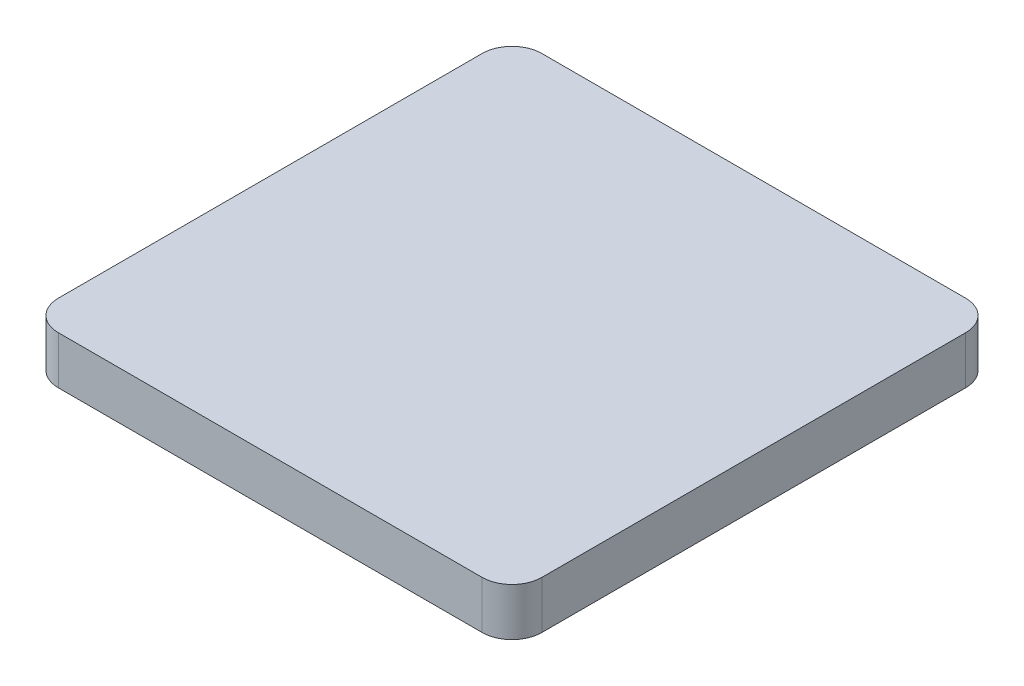
ISO-10303-21;
HEADER;
FILE_DESCRIPTION(('STEP AP214'),'2;1');
FILE_NAME('part.step','',(''),(''),'','','');
FILE_SCHEMA(('AUTOMOTIVE_DESIGN { 1 0 10303 214 1 1 1 1 }'));
ENDSEC;
DATA;
#1=APPLICATION_CONTEXT('core data for automotive mechanical design processes');
#2=APPLICATION_PROTOCOL_DEFINITION('international standard','automotive_design',2000,#1);
#3=PRODUCT_CONTEXT('',#1,'mechanical');
#4=PRODUCT('Part','Part','',(#3));
#5=PRODUCT_RELATED_PRODUCT_CATEGORY('part','',(#4));
#6=PRODUCT_DEFINITION_FORMATION('','',#4);
#7=PRODUCT_DEFINITION_CONTEXT('part definition',#1,'design');
#8=PRODUCT_DEFINITION('design','',#6,#7);
#9=PRODUCT_DEFINITION_SHAPE('','',#8);
#10=(LENGTH_UNIT() NAMED_UNIT(*) SI_UNIT(.MILLI.,.METRE.));
#11=(NAMED_UNIT(*) PLANE_ANGLE_UNIT() SI_UNIT($,.RADIAN.));
#12=(NAMED_UNIT(*) SI_UNIT($,.STERADIAN.) SOLID_ANGLE_UNIT());
#13=UNCERTAINTY_MEASURE_WITH_UNIT(LENGTH_MEASURE(1.E-05),#10,'distance_accuracy_value','');
#14=(GEOMETRIC_REPRESENTATION_CONTEXT(3) GLOBAL_UNCERTAINTY_ASSIGNED_CONTEXT((#13)) GLOBAL_UNIT_ASSIGNED_CONTEXT((#10,
#11,#12)) REPRESENTATION_CONTEXT('',''));
#15=CARTESIAN_POINT('',(0.,0.,0.));
#16=DIRECTION('',(0.,0.,1.));
#17=DIRECTION('',(1.,0.,0.));
#18=AXIS2_PLACEMENT_3D('',#15,#16,#17);
#19=CARTESIAN_POINT('',(0.,4.,40.5));
#20=DIRECTION('',(0.,0.,-1.));
#21=DIRECTION('',(-1.,0.,0.));
#22=AXIS2_PLACEMENT_3D('',#19,#20,#21);
#23=PLANE('',#22);
#24=DIRECTION('',(1.,0.,0.));
#25=VECTOR('',#24,1.);
#26=CARTESIAN_POINT('',(0.,-4.,40.5));
#27=LINE('',#26,#25);
#28=CARTESIAN_POINT('',(-35.5,-4.,40.5));
#29=VERTEX_POINT('',#28);
#30=CARTESIAN_POINT('',(35.5,-4.,40.5));
#31=VERTEX_POINT('',#30);
#32=EDGE_CURVE('E229',#29,#31,#27,.T.);
#33=ORIENTED_EDGE('',*,*,#32,.T.);
#34=DIRECTION('',(0.,-1.,0.));
#35=VECTOR('',#34,1.);
#36=CARTESIAN_POINT('',(35.5,4.,40.5));
#37=LINE('',#36,#35);
#38=CARTESIAN_POINT('',(35.5,4.,40.5));
#39=VERTEX_POINT('',#38);
#40=EDGE_CURVE('E281',#31,#39,#37,.F.);
#41=ORIENTED_EDGE('',*,*,#40,.T.);
#42=DIRECTION('',(1.,0.,0.));
#43=VECTOR('',#42,1.);
#44=CARTESIAN_POINT('',(0.,4.,40.5));
#45=LINE('',#44,#43);
#46=CARTESIAN_POINT('',(-35.5,4.,40.5));
#47=VERTEX_POINT('',#46);
#48=EDGE_CURVE('E243',#47,#39,#45,.T.);
#49=ORIENTED_EDGE('',*,*,#48,.F.);
#50=DIRECTION('',(0.,-1.,0.));
#51=VECTOR('',#50,1.);
#52=CARTESIAN_POINT('',(-35.5,-4.,40.5));
#53=LINE('',#52,#51);
#54=EDGE_CURVE('E278',#47,#29,#53,.T.);
#55=ORIENTED_EDGE('',*,*,#54,.T.);
#56=EDGE_LOOP('',(#33,#41,#49,#55));
#57=FACE_BOUND('',#56,.T.);
#58=ADVANCED_FACE('F39',(#57),#23,.F.);
#59=CARTESIAN_POINT('',(40.5,4.,0.));
#60=DIRECTION('',(-1.,0.,0.));
#61=DIRECTION('',(0.,0.,1.));
#62=AXIS2_PLACEMENT_3D('',#59,#60,#61);
#63=PLANE('',#62);
#64=DIRECTION('',(0.,0.,-1.));
#65=VECTOR('',#64,1.);
#66=CARTESIAN_POINT('',(40.5,4.,0.));
#67=LINE('',#66,#65);
#68=CARTESIAN_POINT('',(40.5,4.,35.5));
#69=VERTEX_POINT('',#68);
#70=CARTESIAN_POINT('',(40.5,4.,-35.5));
#71=VERTEX_POINT('',#70);
#72=EDGE_CURVE('E246',#69,#71,#67,.T.);
#73=ORIENTED_EDGE('',*,*,#72,.F.);
#74=DIRECTION('',(0.,-1.,0.));
#75=VECTOR('',#74,1.);
#76=CARTESIAN_POINT('',(40.5,4.,35.5));
#77=LINE('',#76,#75);
#78=CARTESIAN_POINT('',(40.5,-4.,35.5));
#79=VERTEX_POINT('',#78);
#80=EDGE_CURVE('E267',#69,#79,#77,.T.);
#81=ORIENTED_EDGE('',*,*,#80,.T.);
#82=DIRECTION('',(0.,0.,-1.));
#83=VECTOR('',#82,1.);
#84=CARTESIAN_POINT('',(40.5,-4.,0.));
#85=LINE('',#84,#83);
#86=CARTESIAN_POINT('',(40.5,-4.,-35.5));
#87=VERTEX_POINT('',#86);
#88=EDGE_CURVE('E258',#79,#87,#85,.T.);
#89=ORIENTED_EDGE('',*,*,#88,.T.);
#90=DIRECTION('',(0.,-1.,0.));
#91=VECTOR('',#90,1.);
#92=CARTESIAN_POINT('',(40.5,4.,-35.5));
#93=LINE('',#92,#91);
#94=EDGE_CURVE('E255',#87,#71,#93,.F.);
#95=ORIENTED_EDGE('',*,*,#94,.T.);
#96=EDGE_LOOP('',(#73,#81,#89,#95));
#97=FACE_BOUND('',#96,.T.);
#98=ADVANCED_FACE('F320',(#97),#63,.F.);
#99=CARTESIAN_POINT('',(0.,4.,-40.5));
#100=DIRECTION('',(0.,0.,-1.));
#101=DIRECTION('',(-1.,0.,0.));
#102=AXIS2_PLACEMENT_3D('',#99,#100,#101);
#103=PLANE('',#102);
#104=DIRECTION('',(1.,0.,0.));
#105=VECTOR('',#104,1.);
#106=CARTESIAN_POINT('',(0.,4.,-40.5));
#107=LINE('',#106,#105);
#108=CARTESIAN_POINT('',(-35.5,4.,-40.5));
#109=VERTEX_POINT('',#108);
#110=CARTESIAN_POINT('',(35.5,4.,-40.5));
#111=VERTEX_POINT('',#110);
#112=EDGE_CURVE('E250',#109,#111,#107,.T.);
#113=ORIENTED_EDGE('',*,*,#112,.T.);
#114=DIRECTION('',(0.,-1.,0.));
#115=VECTOR('',#114,1.);
#116=CARTESIAN_POINT('',(35.5,-4.,-40.5));
#117=LINE('',#116,#115);
#118=CARTESIAN_POINT('',(35.5,-4.,-40.5));
#119=VERTEX_POINT('',#118);
#120=EDGE_CURVE('E292',#111,#119,#117,.T.);
#121=ORIENTED_EDGE('',*,*,#120,.T.);
#122=DIRECTION('',(1.,0.,0.));
#123=VECTOR('',#122,1.);
#124=CARTESIAN_POINT('',(0.,-4.,-40.5));
#125=LINE('',#124,#123);
#126=CARTESIAN_POINT('',(-35.5,-4.,-40.5));
#127=VERTEX_POINT('',#126);
#128=EDGE_CURVE('E261',#127,#119,#125,.T.);
#129=ORIENTED_EDGE('',*,*,#128,.F.);
#130=DIRECTION('',(0.,-1.,0.));
#131=VECTOR('',#130,1.);
#132=CARTESIAN_POINT('',(-35.5,4.,-40.5));
#133=LINE('',#132,#131);
#134=EDGE_CURVE('E290',#127,#109,#133,.F.);
#135=ORIENTED_EDGE('',*,*,#134,.T.);
#136=EDGE_LOOP('',(#113,#121,#129,#135));
#137=FACE_BOUND('',#136,.T.);
#138=ADVANCED_FACE('F297',(#137),#103,.T.);
#139=CARTESIAN_POINT('',(-40.5,4.,0.));
#140=DIRECTION('',(-1.,0.,0.));
#141=DIRECTION('',(0.,0.,1.));
#142=AXIS2_PLACEMENT_3D('',#139,#140,#141);
#143=PLANE('',#142);
#144=DIRECTION('',(0.,0.,-1.));
#145=VECTOR('',#144,1.);
#146=CARTESIAN_POINT('',(-40.5,4.,0.));
#147=LINE('',#146,#145);
#148=CARTESIAN_POINT('',(-40.5,4.,35.5));
#149=VERTEX_POINT('',#148);
#150=CARTESIAN_POINT('',(-40.5,4.,-35.5));
#151=VERTEX_POINT('',#150);
#152=EDGE_CURVE('E253',#149,#151,#147,.T.);
#153=ORIENTED_EDGE('',*,*,#152,.T.);
#154=DIRECTION('',(0.,-1.,0.));
#155=VECTOR('',#154,1.);
#156=CARTESIAN_POINT('',(-40.5,4.,-35.5));
#157=LINE('',#156,#155);
#158=CARTESIAN_POINT('',(-40.5,-4.,-35.5));
#159=VERTEX_POINT('',#158);
#160=EDGE_CURVE('E11',#151,#159,#157,.T.);
#161=ORIENTED_EDGE('',*,*,#160,.T.);
#162=DIRECTION('',(0.,0.,-1.));
#163=VECTOR('',#162,1.);
#164=CARTESIAN_POINT('',(-40.5,-4.,0.));
#165=LINE('',#164,#163);
#166=CARTESIAN_POINT('',(-40.5,-4.,35.5));
#167=VERTEX_POINT('',#166);
#168=EDGE_CURVE('E247',#167,#159,#165,.T.);
#169=ORIENTED_EDGE('',*,*,#168,.F.);
#170=DIRECTION('',(0.,-1.,0.));
#171=VECTOR('',#170,1.);
#172=CARTESIAN_POINT('',(-40.5,4.,35.5));
#173=LINE('',#172,#171);
#174=EDGE_CURVE('E47',#167,#149,#173,.F.);
#175=ORIENTED_EDGE('',*,*,#174,.T.);
#176=EDGE_LOOP('',(#153,#161,#169,#175));
#177=FACE_BOUND('',#176,.T.);
#178=ADVANCED_FACE('F305',(#177),#143,.T.);
#179=CARTESIAN_POINT('',(0.,4.,0.));
#180=DIRECTION('',(0.,1.,0.));
#181=DIRECTION('',(0.,0.,1.));
#182=AXIS2_PLACEMENT_3D('',#179,#180,#181);
#183=PLANE('',#182);
#184=ORIENTED_EDGE('',*,*,#48,.T.);
#185=CARTESIAN_POINT('',(35.5,4.,35.5));
#186=DIRECTION('',(0.,1.,0.));
#187=DIRECTION('',(0.,0.,1.));
#188=AXIS2_PLACEMENT_3D('',#185,#186,#187);
#189=CIRCLE('',#188,5.);
#190=EDGE_CURVE('E288',#39,#69,#189,.T.);
#191=ORIENTED_EDGE('',*,*,#190,.T.);
#192=ORIENTED_EDGE('',*,*,#72,.T.);
#193=CARTESIAN_POINT('',(35.5,4.,-35.5));
#194=DIRECTION('',(0.,1.,0.));
#195=DIRECTION('',(0.,0.,1.));
#196=AXIS2_PLACEMENT_3D('',#193,#194,#195);
#197=CIRCLE('',#196,5.);
#198=EDGE_CURVE('E286',#71,#111,#197,.T.);
#199=ORIENTED_EDGE('',*,*,#198,.T.);
#200=ORIENTED_EDGE('',*,*,#112,.F.);
#201=CARTESIAN_POINT('',(-35.5,4.,-35.5));
#202=DIRECTION('',(0.,1.,0.));
#203=DIRECTION('',(0.,0.,1.));
#204=AXIS2_PLACEMENT_3D('',#201,#202,#203);
#205=CIRCLE('',#204,5.);
#206=EDGE_CURVE('E54',#109,#151,#205,.T.);
#207=ORIENTED_EDGE('',*,*,#206,.T.);
#208=ORIENTED_EDGE('',*,*,#152,.F.);
#209=CARTESIAN_POINT('',(-35.5,4.,35.5));
#210=DIRECTION('',(0.,1.,0.));
#211=DIRECTION('',(0.,0.,1.));
#212=AXIS2_PLACEMENT_3D('',#209,#210,#211);
#213=CIRCLE('',#212,5.);
#214=EDGE_CURVE('E283',#149,#47,#213,.T.);
#215=ORIENTED_EDGE('',*,*,#214,.T.);
#216=EDGE_LOOP('',(#184,#191,#192,#199,#200,#207,#208,#215));
#217=FACE_BOUND('',#216,.T.);
#218=ADVANCED_FACE('F307',(#217),#183,.T.);
#219=CARTESIAN_POINT('',(0.,-4.,0.));
#220=DIRECTION('',(0.,1.,0.));
#221=DIRECTION('',(0.,0.,1.));
#222=AXIS2_PLACEMENT_3D('',#219,#220,#221);
#223=PLANE('',#222);
#224=CARTESIAN_POINT('',(32.5,-4.,-32.5));
#225=DIRECTION('',(0.,1.,0.));
#226=DIRECTION('',(0.,0.,1.));
#227=AXIS2_PLACEMENT_3D('',#224,#225,#226);
#228=CIRCLE('',#227,4.);
#229=CARTESIAN_POINT('',(36.5,-4.,-32.5));
#230=VERTEX_POINT('',#229);
#231=CARTESIAN_POINT('',(32.5,-4.,-36.5));
#232=VERTEX_POINT('',#231);
#233=EDGE_CURVE('E171',#230,#232,#228,.T.);
#234=ORIENTED_EDGE('',*,*,#233,.T.);
#235=CARTESIAN_POINT('',(27.5,-4.,-36.5));
#236=DIRECTION('',(0.,-1.,0.));
#237=DIRECTION('',(0.,0.,1.));
#238=AXIS2_PLACEMENT_3D('',#235,#236,#237);
#239=CIRCLE('',#238,5.);
#240=CARTESIAN_POINT('',(22.5,-4.,-36.5));
#241=VERTEX_POINT('',#240);
#242=EDGE_CURVE('E163',#232,#241,#239,.T.);
#243=ORIENTED_EDGE('',*,*,#242,.T.);
#244=DIRECTION('',(-1.,0.,0.));
#245=VECTOR('',#244,1.);
#246=CARTESIAN_POINT('',(22.5,-4.,-36.5));
#247=LINE('',#246,#245);
#248=CARTESIAN_POINT('',(-32.5,-4.,-36.5));
#249=VERTEX_POINT('',#248);
#250=EDGE_CURVE('E175',#241,#249,#247,.T.);
#251=ORIENTED_EDGE('',*,*,#250,.T.);
#252=CARTESIAN_POINT('',(-32.5,-4.,-32.5));
#253=DIRECTION('',(0.,1.,0.));
#254=DIRECTION('',(0.,0.,1.));
#255=AXIS2_PLACEMENT_3D('',#252,#253,#254);
#256=CIRCLE('',#255,4.);
#257=CARTESIAN_POINT('',(-36.5,-4.,-32.5));
#258=VERTEX_POINT('',#257);
#259=EDGE_CURVE('E179',#249,#258,#256,.T.);
#260=ORIENTED_EDGE('',*,*,#259,.T.);
#261=DIRECTION('',(0.,0.,1.));
#262=VECTOR('',#261,1.);
#263=CARTESIAN_POINT('',(-36.5,-4.,-32.5));
#264=LINE('',#263,#262);
#265=CARTESIAN_POINT('',(-36.5,-4.,32.5));
#266=VERTEX_POINT('',#265);
#267=EDGE_CURVE('E192',#258,#266,#264,.T.);
#268=ORIENTED_EDGE('',*,*,#267,.T.);
#269=CARTESIAN_POINT('',(-32.5,-4.,32.5));
#270=DIRECTION('',(0.,1.,0.));
#271=DIRECTION('',(0.,0.,1.));
#272=AXIS2_PLACEMENT_3D('',#269,#270,#271);
#273=CIRCLE('',#272,4.);
#274=CARTESIAN_POINT('',(-32.5,-4.,36.5));
#275=VERTEX_POINT('',#274);
#276=EDGE_CURVE('E195',#266,#275,#273,.T.);
#277=ORIENTED_EDGE('',*,*,#276,.T.);
#278=DIRECTION('',(1.,0.,0.));
#279=VECTOR('',#278,1.);
#280=CARTESIAN_POINT('',(-32.5,-4.,36.5));
#281=LINE('',#280,#279);
#282=CARTESIAN_POINT('',(32.5,-4.,36.5));
#283=VERTEX_POINT('',#282);
#284=EDGE_CURVE('E198',#275,#283,#281,.T.);
#285=ORIENTED_EDGE('',*,*,#284,.T.);
#286=CARTESIAN_POINT('',(32.5,-4.,32.5));
#287=DIRECTION('',(0.,1.,0.));
#288=DIRECTION('',(0.,0.,1.));
#289=AXIS2_PLACEMENT_3D('',#286,#287,#288);
#290=CIRCLE('',#289,4.);
#291=CARTESIAN_POINT('',(36.5,-4.,32.5));
#292=VERTEX_POINT('',#291);
#293=EDGE_CURVE('E201',#283,#292,#290,.T.);
#294=ORIENTED_EDGE('',*,*,#293,.T.);
#295=DIRECTION('',(0.,0.,-1.));
#296=VECTOR('',#295,1.);
#297=CARTESIAN_POINT('',(36.5,-4.,32.5));
#298=LINE('',#297,#296);
#299=EDGE_CURVE('E204',#292,#230,#298,.T.);
#300=ORIENTED_EDGE('',*,*,#299,.T.);
#301=EDGE_LOOP('',(#234,#243,#251,#260,#268,#277,#285,#294,#300));
#302=FACE_BOUND('',#301,.T.);
#303=ORIENTED_EDGE('',*,*,#88,.F.);
#304=CARTESIAN_POINT('',(35.5,-4.,35.5));
#305=DIRECTION('',(0.,1.,0.));
#306=DIRECTION('',(0.,0.,1.));
#307=AXIS2_PLACEMENT_3D('',#304,#305,#306);
#308=CIRCLE('',#307,5.);
#309=EDGE_CURVE('E276',#79,#31,#308,.F.);
#310=ORIENTED_EDGE('',*,*,#309,.T.);
#311=ORIENTED_EDGE('',*,*,#32,.F.);
#312=CARTESIAN_POINT('',(-35.5,-4.,35.5));
#313=DIRECTION('',(0.,1.,0.));
#314=DIRECTION('',(0.,0.,1.));
#315=AXIS2_PLACEMENT_3D('',#312,#313,#314);
#316=CIRCLE('',#315,5.);
#317=EDGE_CURVE('E270',#29,#167,#316,.F.);
#318=ORIENTED_EDGE('',*,*,#317,.T.);
#319=ORIENTED_EDGE('',*,*,#168,.T.);
#320=CARTESIAN_POINT('',(-35.5,-4.,-35.5));
#321=DIRECTION('',(0.,1.,0.));
#322=DIRECTION('',(0.,0.,1.));
#323=AXIS2_PLACEMENT_3D('',#320,#321,#322);
#324=CIRCLE('',#323,5.);
#325=EDGE_CURVE('E272',#159,#127,#324,.F.);
#326=ORIENTED_EDGE('',*,*,#325,.T.);
#327=ORIENTED_EDGE('',*,*,#128,.T.);
#328=CARTESIAN_POINT('',(35.5,-4.,-35.5));
#329=DIRECTION('',(0.,1.,0.));
#330=DIRECTION('',(0.,0.,1.));
#331=AXIS2_PLACEMENT_3D('',#328,#329,#330);
#332=CIRCLE('',#331,5.);
#333=EDGE_CURVE('E274',#119,#87,#332,.F.);
#334=ORIENTED_EDGE('',*,*,#333,.T.);
#335=EDGE_LOOP('',(#303,#310,#311,#318,#319,#326,#327,#334));
#336=FACE_BOUND('',#335,.T.);
#337=ADVANCED_FACE('F181',(#302,#336),#223,.F.);
#338=CARTESIAN_POINT('',(27.5,-4.,-36.5));
#339=DIRECTION('',(0.,1.,0.));
#340=DIRECTION('',(0.,0.,1.));
#341=AXIS2_PLACEMENT_3D('',#338,#339,#340);
#342=CYLINDRICAL_SURFACE('',#341,5.);
#343=CARTESIAN_POINT('',(27.5,0.,-36.5));
#344=DIRECTION('',(0.,-1.,0.));
#345=DIRECTION('',(0.,0.,1.));
#346=AXIS2_PLACEMENT_3D('',#343,#344,#345);
#347=CIRCLE('',#346,5.);
#348=CARTESIAN_POINT('',(32.5,0.,-36.5));
#349=VERTEX_POINT('',#348);
#350=CARTESIAN_POINT('',(22.5,0.,-36.5));
#351=VERTEX_POINT('',#350);
#352=EDGE_CURVE('E166',#349,#351,#347,.T.);
#353=ORIENTED_EDGE('',*,*,#352,.T.);
#354=DIRECTION('',(0.,1.,0.));
#355=VECTOR('',#354,1.);
#356=CARTESIAN_POINT('',(22.5,-4.,-36.5));
#357=LINE('',#356,#355);
#358=EDGE_CURVE('E159',#241,#351,#357,.T.);
#359=ORIENTED_EDGE('',*,*,#358,.F.);
#360=ORIENTED_EDGE('',*,*,#242,.F.);
#361=DIRECTION('',(0.,1.,0.));
#362=VECTOR('',#361,1.);
#363=CARTESIAN_POINT('',(32.5,-4.,-36.5));
#364=LINE('',#363,#362);
#365=EDGE_CURVE('E227',#232,#349,#364,.T.);
#366=ORIENTED_EDGE('',*,*,#365,.T.);
#367=EDGE_LOOP('',(#353,#359,#360,#366));
#368=FACE_BOUND('',#367,.T.);
#369=ADVANCED_FACE('F161',(#368),#342,.T.);
#370=CARTESIAN_POINT('',(32.5,-4.,-32.5));
#371=DIRECTION('',(0.,1.,0.));
#372=DIRECTION('',(0.,0.,1.));
#373=AXIS2_PLACEMENT_3D('',#370,#371,#372);
#374=CYLINDRICAL_SURFACE('',#373,4.);
#375=CARTESIAN_POINT('',(32.5,0.,-32.5));
#376=DIRECTION('',(0.,1.,0.));
#377=DIRECTION('',(0.,0.,1.));
#378=AXIS2_PLACEMENT_3D('',#375,#376,#377);
#379=CIRCLE('',#378,4.);
#380=CARTESIAN_POINT('',(36.5,0.,-32.5));
#381=VERTEX_POINT('',#380);
#382=EDGE_CURVE('E185',#381,#349,#379,.T.);
#383=ORIENTED_EDGE('',*,*,#382,.T.);
#384=ORIENTED_EDGE('',*,*,#365,.F.);
#385=ORIENTED_EDGE('',*,*,#233,.F.);
#386=DIRECTION('',(0.,1.,0.));
#387=VECTOR('',#386,1.);
#388=CARTESIAN_POINT('',(36.5,-4.,-32.5));
#389=LINE('',#388,#387);
#390=EDGE_CURVE('E230',#230,#381,#389,.T.);
#391=ORIENTED_EDGE('',*,*,#390,.T.);
#392=EDGE_LOOP('',(#383,#384,#385,#391));
#393=FACE_BOUND('',#392,.T.);
#394=ADVANCED_FACE('F349',(#393),#374,.F.);
#395=CARTESIAN_POINT('',(36.5,-4.,32.5));
#396=DIRECTION('',(1.,0.,0.));
#397=DIRECTION('',(0.,0.,-1.));
#398=AXIS2_PLACEMENT_3D('',#395,#396,#397);
#399=PLANE('',#398);
#400=DIRECTION('',(0.,0.,-1.));
#401=VECTOR('',#400,1.);
#402=CARTESIAN_POINT('',(36.5,0.,32.5));
#403=LINE('',#402,#401);
#404=CARTESIAN_POINT('',(36.5,0.,32.5));
#405=VERTEX_POINT('',#404);
#406=EDGE_CURVE('E188',#405,#381,#403,.T.);
#407=ORIENTED_EDGE('',*,*,#406,.T.);
#408=ORIENTED_EDGE('',*,*,#390,.F.);
#409=ORIENTED_EDGE('',*,*,#299,.F.);
#410=DIRECTION('',(0.,1.,0.));
#411=VECTOR('',#410,1.);
#412=CARTESIAN_POINT('',(36.5,-4.,32.5));
#413=LINE('',#412,#411);
#414=EDGE_CURVE('E232',#292,#405,#413,.T.);
#415=ORIENTED_EDGE('',*,*,#414,.T.);
#416=EDGE_LOOP('',(#407,#408,#409,#415));
#417=FACE_BOUND('',#416,.T.);
#418=ADVANCED_FACE('F371',(#417),#399,.F.);
#419=CARTESIAN_POINT('',(32.5,-4.,32.5));
#420=DIRECTION('',(0.,1.,0.));
#421=DIRECTION('',(0.,0.,1.));
#422=AXIS2_PLACEMENT_3D('',#419,#420,#421);
#423=CYLINDRICAL_SURFACE('',#422,4.);
#424=CARTESIAN_POINT('',(32.5,0.,32.5));
#425=DIRECTION('',(0.,1.,0.));
#426=DIRECTION('',(0.,0.,1.));
#427=AXIS2_PLACEMENT_3D('',#424,#425,#426);
#428=CIRCLE('',#427,4.);
#429=CARTESIAN_POINT('',(32.5,0.,36.5));
#430=VERTEX_POINT('',#429);
#431=EDGE_CURVE('E222',#430,#405,#428,.T.);
#432=ORIENTED_EDGE('',*,*,#431,.T.);
#433=ORIENTED_EDGE('',*,*,#414,.F.);
#434=ORIENTED_EDGE('',*,*,#293,.F.);
#435=DIRECTION('',(0.,1.,0.));
#436=VECTOR('',#435,1.);
#437=CARTESIAN_POINT('',(32.5,-4.,36.5));
#438=LINE('',#437,#436);
#439=EDGE_CURVE('E234',#283,#430,#438,.T.);
#440=ORIENTED_EDGE('',*,*,#439,.T.);
#441=EDGE_LOOP('',(#432,#433,#434,#440));
#442=FACE_BOUND('',#441,.T.);
#443=ADVANCED_FACE('F367',(#442),#423,.F.);
#444=CARTESIAN_POINT('',(-32.5,-4.,36.5));
#445=DIRECTION('',(0.,0.,1.));
#446=DIRECTION('',(1.,0.,0.));
#447=AXIS2_PLACEMENT_3D('',#444,#445,#446);
#448=PLANE('',#447);
#449=DIRECTION('',(1.,0.,0.));
#450=VECTOR('',#449,1.);
#451=CARTESIAN_POINT('',(-32.5,0.,36.5));
#452=LINE('',#451,#450);
#453=CARTESIAN_POINT('',(-32.5,0.,36.5));
#454=VERTEX_POINT('',#453);
#455=EDGE_CURVE('E219',#454,#430,#452,.T.);
#456=ORIENTED_EDGE('',*,*,#455,.T.);
#457=ORIENTED_EDGE('',*,*,#439,.F.);
#458=ORIENTED_EDGE('',*,*,#284,.F.);
#459=DIRECTION('',(0.,1.,0.));
#460=VECTOR('',#459,1.);
#461=CARTESIAN_POINT('',(-32.5,-4.,36.5));
#462=LINE('',#461,#460);
#463=EDGE_CURVE('E236',#275,#454,#462,.T.);
#464=ORIENTED_EDGE('',*,*,#463,.T.);
#465=EDGE_LOOP('',(#456,#457,#458,#464));
#466=FACE_BOUND('',#465,.T.);
#467=ADVANCED_FACE('F363',(#466),#448,.F.);
#468=CARTESIAN_POINT('',(-32.5,-4.,32.5));
#469=DIRECTION('',(0.,1.,0.));
#470=DIRECTION('',(0.,0.,1.));
#471=AXIS2_PLACEMENT_3D('',#468,#469,#470);
#472=CYLINDRICAL_SURFACE('',#471,4.);
#473=CARTESIAN_POINT('',(-32.5,0.,32.5));
#474=DIRECTION('',(0.,1.,0.));
#475=DIRECTION('',(0.,0.,1.));
#476=AXIS2_PLACEMENT_3D('',#473,#474,#475);
#477=CIRCLE('',#476,4.);
#478=CARTESIAN_POINT('',(-36.5,0.,32.5));
#479=VERTEX_POINT('',#478);
#480=EDGE_CURVE('E216',#479,#454,#477,.T.);
#481=ORIENTED_EDGE('',*,*,#480,.T.);
#482=ORIENTED_EDGE('',*,*,#463,.F.);
#483=ORIENTED_EDGE('',*,*,#276,.F.);
#484=DIRECTION('',(0.,1.,0.));
#485=VECTOR('',#484,1.);
#486=CARTESIAN_POINT('',(-36.5,-4.,32.5));
#487=LINE('',#486,#485);
#488=EDGE_CURVE('E238',#266,#479,#487,.T.);
#489=ORIENTED_EDGE('',*,*,#488,.T.);
#490=EDGE_LOOP('',(#481,#482,#483,#489));
#491=FACE_BOUND('',#490,.T.);
#492=ADVANCED_FACE('F359',(#491),#472,.F.);
#493=CARTESIAN_POINT('',(-36.5,-4.,-32.5));
#494=DIRECTION('',(-1.,0.,0.));
#495=DIRECTION('',(0.,0.,1.));
#496=AXIS2_PLACEMENT_3D('',#493,#494,#495);
#497=PLANE('',#496);
#498=DIRECTION('',(0.,0.,1.));
#499=VECTOR('',#498,1.);
#500=CARTESIAN_POINT('',(-36.5,0.,-32.5));
#501=LINE('',#500,#499);
#502=CARTESIAN_POINT('',(-36.5,0.,-32.5));
#503=VERTEX_POINT('',#502);
#504=EDGE_CURVE('E213',#503,#479,#501,.T.);
#505=ORIENTED_EDGE('',*,*,#504,.T.);
#506=ORIENTED_EDGE('',*,*,#488,.F.);
#507=ORIENTED_EDGE('',*,*,#267,.F.);
#508=DIRECTION('',(0.,1.,0.));
#509=VECTOR('',#508,1.);
#510=CARTESIAN_POINT('',(-36.5,-4.,-32.5));
#511=LINE('',#510,#509);
#512=EDGE_CURVE('E240',#258,#503,#511,.T.);
#513=ORIENTED_EDGE('',*,*,#512,.T.);
#514=EDGE_LOOP('',(#505,#506,#507,#513));
#515=FACE_BOUND('',#514,.T.);
#516=ADVANCED_FACE('F355',(#515),#497,.F.);
#517=CARTESIAN_POINT('',(-32.5,-4.,-32.5));
#518=DIRECTION('',(0.,1.,0.));
#519=DIRECTION('',(0.,0.,1.));
#520=AXIS2_PLACEMENT_3D('',#517,#518,#519);
#521=CYLINDRICAL_SURFACE('',#520,4.);
#522=CARTESIAN_POINT('',(-32.5,0.,-32.5));
#523=DIRECTION('',(0.,1.,0.));
#524=DIRECTION('',(0.,0.,1.));
#525=AXIS2_PLACEMENT_3D('',#522,#523,#524);
#526=CIRCLE('',#525,4.);
#527=CARTESIAN_POINT('',(-32.5,0.,-36.5));
#528=VERTEX_POINT('',#527);
#529=EDGE_CURVE('E210',#528,#503,#526,.T.);
#530=ORIENTED_EDGE('',*,*,#529,.T.);
#531=ORIENTED_EDGE('',*,*,#512,.F.);
#532=ORIENTED_EDGE('',*,*,#259,.F.);
#533=DIRECTION('',(0.,1.,0.));
#534=VECTOR('',#533,1.);
#535=CARTESIAN_POINT('',(-32.5,-4.,-36.5));
#536=LINE('',#535,#534);
#537=EDGE_CURVE('E170',#249,#528,#536,.T.);
#538=ORIENTED_EDGE('',*,*,#537,.T.);
#539=EDGE_LOOP('',(#530,#531,#532,#538));
#540=FACE_BOUND('',#539,.T.);
#541=ADVANCED_FACE('F352',(#540),#521,.F.);
#542=CARTESIAN_POINT('',(22.5,-4.,-36.5));
#543=DIRECTION('',(0.,0.,-1.));
#544=DIRECTION('',(-1.,0.,0.));
#545=AXIS2_PLACEMENT_3D('',#542,#543,#544);
#546=PLANE('',#545);
#547=DIRECTION('',(-1.,0.,0.));
#548=VECTOR('',#547,1.);
#549=CARTESIAN_POINT('',(22.5,0.,-36.5));
#550=LINE('',#549,#548);
#551=EDGE_CURVE('E208',#351,#528,#550,.T.);
#552=ORIENTED_EDGE('',*,*,#551,.T.);
#553=ORIENTED_EDGE('',*,*,#537,.F.);
#554=ORIENTED_EDGE('',*,*,#250,.F.);
#555=ORIENTED_EDGE('',*,*,#358,.T.);
#556=EDGE_LOOP('',(#552,#553,#554,#555));
#557=FACE_BOUND('',#556,.T.);
#558=ADVANCED_FACE('F176',(#557),#546,.F.);
#559=CARTESIAN_POINT('',(27.5,0.,-36.5));
#560=DIRECTION('',(0.,1.,0.));
#561=DIRECTION('',(0.,0.,1.));
#562=AXIS2_PLACEMENT_3D('',#559,#560,#561);
#563=PLANE('',#562);
#564=ORIENTED_EDGE('',*,*,#352,.F.);
#565=ORIENTED_EDGE('',*,*,#382,.F.);
#566=ORIENTED_EDGE('',*,*,#406,.F.);
#567=ORIENTED_EDGE('',*,*,#431,.F.);
#568=ORIENTED_EDGE('',*,*,#455,.F.);
#569=ORIENTED_EDGE('',*,*,#480,.F.);
#570=ORIENTED_EDGE('',*,*,#504,.F.);
#571=ORIENTED_EDGE('',*,*,#529,.F.);
#572=ORIENTED_EDGE('',*,*,#551,.F.);
#573=EDGE_LOOP('',(#564,#565,#566,#567,#568,#569,#570,#571,#572));
#574=FACE_BOUND('',#573,.T.);
#575=ADVANCED_FACE('F329',(#574),#563,.F.);
#576=CARTESIAN_POINT('',(35.5,4.,35.5));
#577=DIRECTION('',(0.,-1.,0.));
#578=DIRECTION('',(0.,0.,-1.));
#579=AXIS2_PLACEMENT_3D('',#576,#577,#578);
#580=CYLINDRICAL_SURFACE('',#579,5.);
#581=ORIENTED_EDGE('',*,*,#190,.F.);
#582=ORIENTED_EDGE('',*,*,#40,.F.);
#583=ORIENTED_EDGE('',*,*,#309,.F.);
#584=ORIENTED_EDGE('',*,*,#80,.F.);
#585=EDGE_LOOP('',(#581,#582,#583,#584));
#586=FACE_BOUND('',#585,.T.);
#587=ADVANCED_FACE('F317',(#586),#580,.T.);
#588=CARTESIAN_POINT('',(35.5,4.,-35.5));
#589=DIRECTION('',(0.,1.,0.));
#590=DIRECTION('',(0.,0.,1.));
#591=AXIS2_PLACEMENT_3D('',#588,#589,#590);
#592=CYLINDRICAL_SURFACE('',#591,5.);
#593=ORIENTED_EDGE('',*,*,#198,.F.);
#594=ORIENTED_EDGE('',*,*,#94,.F.);
#595=ORIENTED_EDGE('',*,*,#333,.F.);
#596=ORIENTED_EDGE('',*,*,#120,.F.);
#597=EDGE_LOOP('',(#593,#594,#595,#596));
#598=FACE_BOUND('',#597,.T.);
#599=ADVANCED_FACE('F322',(#598),#592,.T.);
#600=CARTESIAN_POINT('',(-35.5,4.,-35.5));
#601=DIRECTION('',(0.,-1.,0.));
#602=DIRECTION('',(0.,0.,-1.));
#603=AXIS2_PLACEMENT_3D('',#600,#601,#602);
#604=CYLINDRICAL_SURFACE('',#603,5.);
#605=ORIENTED_EDGE('',*,*,#206,.F.);
#606=ORIENTED_EDGE('',*,*,#134,.F.);
#607=ORIENTED_EDGE('',*,*,#325,.F.);
#608=ORIENTED_EDGE('',*,*,#160,.F.);
#609=EDGE_LOOP('',(#605,#606,#607,#608));
#610=FACE_BOUND('',#609,.T.);
#611=ADVANCED_FACE('F304',(#610),#604,.T.);
#612=CARTESIAN_POINT('',(-35.5,4.,35.5));
#613=DIRECTION('',(0.,1.,0.));
#614=DIRECTION('',(0.,0.,1.));
#615=AXIS2_PLACEMENT_3D('',#612,#613,#614);
#616=CYLINDRICAL_SURFACE('',#615,5.);
#617=ORIENTED_EDGE('',*,*,#214,.F.);
#618=ORIENTED_EDGE('',*,*,#174,.F.);
#619=ORIENTED_EDGE('',*,*,#317,.F.);
#620=ORIENTED_EDGE('',*,*,#54,.F.);
#621=EDGE_LOOP('',(#617,#618,#619,#620));
#622=FACE_BOUND('',#621,.T.);
#623=ADVANCED_FACE('F41',(#622),#616,.T.);
#624=CLOSED_SHELL('',(#58,#98,#138,#178,#218,#337,#369,#394,#418,#443,#467,#492,#516,#541,#558,
#575,#587,#599,#611,#623));
#625=MANIFOLD_SOLID_BREP('B2',#624);
#626=ADVANCED_BREP_SHAPE_REPRESENTATION('',(#18,#625),#14);
#627=SHAPE_DEFINITION_REPRESENTATION(#9,#626);
ENDSEC;
END-ISO-10303-21;
